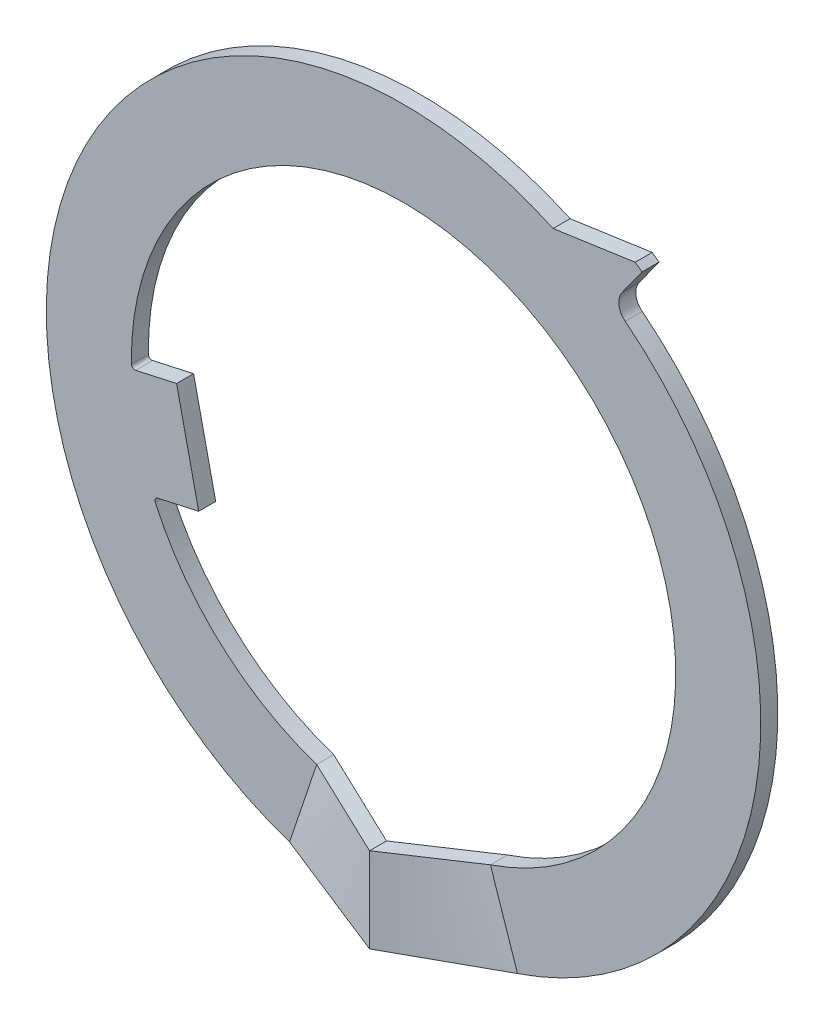
ISO-10303-21;
HEADER;
FILE_DESCRIPTION(('STEP AP214'),'2;1');
FILE_NAME('part.step','',(''),(''),'','','');
FILE_SCHEMA(('AUTOMOTIVE_DESIGN { 1 0 10303 214 1 1 1 1 }'));
ENDSEC;
DATA;
#1=APPLICATION_CONTEXT('core data for automotive mechanical design processes');
#2=APPLICATION_PROTOCOL_DEFINITION('international standard','automotive_design',2000,#1);
#3=PRODUCT_CONTEXT('',#1,'mechanical');
#4=PRODUCT('Part','Part','',(#3));
#5=PRODUCT_RELATED_PRODUCT_CATEGORY('part','',(#4));
#6=PRODUCT_DEFINITION_FORMATION('','',#4);
#7=PRODUCT_DEFINITION_CONTEXT('part definition',#1,'design');
#8=PRODUCT_DEFINITION('design','',#6,#7);
#9=PRODUCT_DEFINITION_SHAPE('','',#8);
#10=(LENGTH_UNIT() NAMED_UNIT(*) SI_UNIT(.MILLI.,.METRE.));
#11=(NAMED_UNIT(*) PLANE_ANGLE_UNIT() SI_UNIT($,.RADIAN.));
#12=(NAMED_UNIT(*) SI_UNIT($,.STERADIAN.) SOLID_ANGLE_UNIT());
#13=UNCERTAINTY_MEASURE_WITH_UNIT(LENGTH_MEASURE(1.E-05),#10,'distance_accuracy_value','');
#14=(GEOMETRIC_REPRESENTATION_CONTEXT(3) GLOBAL_UNCERTAINTY_ASSIGNED_CONTEXT((#13)) GLOBAL_UNIT_ASSIGNED_CONTEXT((#10,
#11,#12)) REPRESENTATION_CONTEXT('',''));
#15=CARTESIAN_POINT('',(0.,0.,0.));
#16=DIRECTION('',(0.,0.,1.));
#17=DIRECTION('',(1.,0.,0.));
#18=AXIS2_PLACEMENT_3D('',#15,#16,#17);
#19=CARTESIAN_POINT('',(0.,0.,-0.5));
#20=DIRECTION('',(0.,0.,1.));
#21=DIRECTION('',(1.,0.,0.));
#22=AXIS2_PLACEMENT_3D('',#19,#20,#21);
#23=CYLINDRICAL_SURFACE('',#22,10.5);
#24=CARTESIAN_POINT('',(0.,0.,0.));
#25=DIRECTION('',(0.,0.,1.));
#26=DIRECTION('',(1.,0.,0.));
#27=AXIS2_PLACEMENT_3D('',#24,#25,#26);
#28=CIRCLE('',#27,10.5);
#29=CARTESIAN_POINT('',(3.35,-9.95125620210835,0.));
#30=VERTEX_POINT('',#29);
#31=CARTESIAN_POINT('',(6.51562292120914,8.2338725973028,0.));
#32=VERTEX_POINT('',#31);
#33=EDGE_CURVE('E419',#30,#32,#28,.T.);
#34=ORIENTED_EDGE('',*,*,#33,.F.);
#35=DIRECTION('',(0.,0.,-1.));
#36=VECTOR('',#35,1.);
#37=CARTESIAN_POINT('',(3.35,-9.95125620210835,0.));
#38=LINE('',#37,#36);
#39=CARTESIAN_POINT('',(3.35,-9.95125620210835,-0.5));
#40=VERTEX_POINT('',#39);
#41=EDGE_CURVE('E187',#30,#40,#38,.T.);
#42=ORIENTED_EDGE('',*,*,#41,.T.);
#43=CARTESIAN_POINT('',(0.,0.,-0.5));
#44=DIRECTION('',(0.,0.,1.));
#45=DIRECTION('',(1.,0.,0.));
#46=AXIS2_PLACEMENT_3D('',#43,#44,#45);
#47=CIRCLE('',#46,10.5);
#48=CARTESIAN_POINT('',(6.51562292120914,8.2338725973028,-0.5));
#49=VERTEX_POINT('',#48);
#50=EDGE_CURVE('E181',#40,#49,#47,.T.);
#51=ORIENTED_EDGE('',*,*,#50,.T.);
#52=DIRECTION('',(0.,0.,1.));
#53=VECTOR('',#52,1.);
#54=CARTESIAN_POINT('',(6.51562292120914,8.2338725973028,-0.5));
#55=LINE('',#54,#53);
#56=EDGE_CURVE('E184',#49,#32,#55,.T.);
#57=ORIENTED_EDGE('',*,*,#56,.T.);
#58=EDGE_LOOP('',(#34,#42,#51,#57));
#59=FACE_BOUND('',#58,.T.);
#60=ADVANCED_FACE('F58',(#59),#23,.T.);
#61=CARTESIAN_POINT('',(4.39592724414307,9.53550332516332,-0.5));
#62=VERTEX_POINT('',#61);
#63=CARTESIAN_POINT('',(-3.35,-9.95125620210835,-0.5));
#64=VERTEX_POINT('',#63);
#65=EDGE_CURVE('E190',#62,#64,#47,.T.);
#66=ORIENTED_EDGE('',*,*,#65,.T.);
#67=DIRECTION('',(0.,0.,1.));
#68=VECTOR('',#67,1.);
#69=CARTESIAN_POINT('',(-3.35,-9.95125620210835,0.));
#70=LINE('',#69,#68);
#71=CARTESIAN_POINT('',(-3.35,-9.95125620210835,0.));
#72=VERTEX_POINT('',#71);
#73=EDGE_CURVE('E212',#72,#64,#70,.F.);
#74=ORIENTED_EDGE('',*,*,#73,.F.);
#75=CARTESIAN_POINT('',(4.39592724414307,9.53550332516332,0.));
#76=VERTEX_POINT('',#75);
#77=EDGE_CURVE('E431',#76,#72,#28,.T.);
#78=ORIENTED_EDGE('',*,*,#77,.F.);
#79=DIRECTION('',(0.,0.,1.));
#80=VECTOR('',#79,1.);
#81=CARTESIAN_POINT('',(4.39592724414307,9.53550332516332,-0.5));
#82=LINE('',#81,#80);
#83=EDGE_CURVE('E439',#62,#76,#82,.T.);
#84=ORIENTED_EDGE('',*,*,#83,.F.);
#85=EDGE_LOOP('',(#66,#74,#78,#84));
#86=FACE_BOUND('',#85,.T.);
#87=ADVANCED_FACE('F486',(#86),#23,.T.);
#88=CARTESIAN_POINT('',(0.,0.,-0.5));
#89=DIRECTION('',(0.,0.,1.));
#90=DIRECTION('',(1.,0.,0.));
#91=AXIS2_PLACEMENT_3D('',#88,#89,#90);
#92=PLANE('',#91);
#93=DIRECTION('',(-0.31904761904762,0.947738685915081,0.));
#94=VECTOR('',#93,1.);
#95=CARTESIAN_POINT('',(2.55238095238095,-7.58190948732065,-0.5));
#96=LINE('',#95,#94);
#97=CARTESIAN_POINT('',(2.55238095238095,-7.58190948732065,-0.5));
#98=VERTEX_POINT('',#97);
#99=EDGE_CURVE('E211',#40,#98,#96,.T.);
#100=ORIENTED_EDGE('',*,*,#99,.T.);
#101=CARTESIAN_POINT('',(0.,0.,-0.5));
#102=DIRECTION('',(0.,0.,1.));
#103=DIRECTION('',(1.,0.,0.));
#104=AXIS2_PLACEMENT_3D('',#101,#102,#103);
#105=CIRCLE('',#104,8.);
#106=CARTESIAN_POINT('',(-7.99919075894747,-0.113785772262406,-0.5));
#107=VERTEX_POINT('',#106);
#108=EDGE_CURVE('E402',#98,#107,#105,.T.);
#109=ORIENTED_EDGE('',*,*,#108,.T.);
#110=CARTESIAN_POINT('',(-7.89920087446063,-0.112363450109126,-0.5));
#111=DIRECTION('',(0.,0.,1.));
#112=DIRECTION('',(1.,0.,0.));
#113=AXIS2_PLACEMENT_3D('',#110,#111,#112);
#114=CIRCLE('',#113,0.1);
#115=CARTESIAN_POINT('',(-7.87755691306682,-0.20999305082112,-0.5));
#116=VERTEX_POINT('',#115);
#117=EDGE_CURVE('E459',#107,#116,#114,.T.);
#118=ORIENTED_EDGE('',*,*,#117,.T.);
#119=DIRECTION('',(0.976296007119934,0.2164396139381,0.));
#120=VECTOR('',#119,1.);
#121=CARTESIAN_POINT('',(-6.67058346718672,0.0575865200822516,-0.5));
#122=LINE('',#121,#120);
#123=CARTESIAN_POINT('',(-6.67058346718672,0.0575865200822516,-0.5));
#124=VERTEX_POINT('',#123);
#125=EDGE_CURVE('E405',#116,#124,#122,.T.);
#126=ORIENTED_EDGE('',*,*,#125,.T.);
#127=DIRECTION('',(0.2164396139381,-0.976296007119934,0.));
#128=VECTOR('',#127,1.);
#129=CARTESIAN_POINT('',(-6.67058346718672,0.0575865200822516,-0.5));
#130=LINE('',#129,#128);
#131=CARTESIAN_POINT('',(-6.02126462537242,-2.87130150127755,-0.5));
#132=VERTEX_POINT('',#131);
#133=EDGE_CURVE('E395',#124,#132,#130,.T.);
#134=ORIENTED_EDGE('',*,*,#133,.T.);
#135=DIRECTION('',(-0.976296007119934,-0.2164396139381,0.));
#136=VECTOR('',#135,1.);
#137=CARTESIAN_POINT('',(-6.02126462537242,-2.87130150127755,-0.5));
#138=LINE('',#137,#136);
#139=CARTESIAN_POINT('',(-7.22823807125252,-3.13888107218092,-0.5));
#140=VERTEX_POINT('',#139);
#141=EDGE_CURVE('E398',#132,#140,#138,.T.);
#142=ORIENTED_EDGE('',*,*,#141,.T.);
#143=CARTESIAN_POINT('',(-7.20659410985871,-3.23651067289292,-0.5));
#144=DIRECTION('',(0.,0.,1.));
#145=DIRECTION('',(1.,0.,0.));
#146=AXIS2_PLACEMENT_3D('',#143,#144,#145);
#147=CIRCLE('',#146,0.1);
#148=CARTESIAN_POINT('',(-7.29781682011008,-3.2774791624232,-0.5));
#149=VERTEX_POINT('',#148);
#150=EDGE_CURVE('E199',#140,#149,#147,.T.);
#151=ORIENTED_EDGE('',*,*,#150,.T.);
#152=CARTESIAN_POINT('',(-2.55238095238095,-7.58190948732065,-0.5));
#153=VERTEX_POINT('',#152);
#154=EDGE_CURVE('E404',#149,#153,#105,.T.);
#155=ORIENTED_EDGE('',*,*,#154,.T.);
#156=DIRECTION('',(-0.319047619047619,-0.947738685915081,0.));
#157=VECTOR('',#156,1.);
#158=CARTESIAN_POINT('',(-2.55238095238095,-7.58190948732065,-0.5));
#159=LINE('',#158,#157);
#160=EDGE_CURVE('E207',#153,#64,#159,.T.);
#161=ORIENTED_EDGE('',*,*,#160,.T.);
#162=ORIENTED_EDGE('',*,*,#65,.F.);
#163=DIRECTION('',(-0.989779692430382,-0.142604910337683,0.));
#164=VECTOR('',#163,1.);
#165=CARTESIAN_POINT('',(4.39592724414307,9.53550332516332,-0.5));
#166=LINE('',#165,#164);
#167=CARTESIAN_POINT('',(6.80659574026715,9.8828262368908,-0.5));
#168=VERTEX_POINT('',#167);
#169=EDGE_CURVE('E426',#168,#62,#166,.T.);
#170=ORIENTED_EDGE('',*,*,#169,.F.);
#171=CARTESIAN_POINT('',(0.,0.,-0.5));
#172=DIRECTION('',(0.,0.,1.));
#173=DIRECTION('',(1.,0.,0.));
#174=AXIS2_PLACEMENT_3D('',#171,#172,#173);
#175=CIRCLE('',#174,12.);
#176=CARTESIAN_POINT('',(7.0109959876493,9.73888778358009,-0.5));
#177=VERTEX_POINT('',#176);
#178=EDGE_CURVE('E423',#177,#168,#175,.T.);
#179=ORIENTED_EDGE('',*,*,#178,.F.);
#180=DIRECTION('',(0.584249665637441,0.811573981965007,0.));
#181=VECTOR('',#180,1.);
#182=CARTESIAN_POINT('',(6.13462148919313,8.52152681063258,-0.5));
#183=LINE('',#182,#181);
#184=CARTESIAN_POINT('',(6.42010368837946,8.91808660142166,-0.5));
#185=VERTEX_POINT('',#184);
#186=EDGE_CURVE('E196',#185,#177,#183,.T.);
#187=ORIENTED_EDGE('',*,*,#186,.F.);
#188=CARTESIAN_POINT('',(6.82589067936196,8.62596176860294,-0.5));
#189=DIRECTION('',(0.,0.,1.));
#190=DIRECTION('',(1.,0.,0.));
#191=AXIS2_PLACEMENT_3D('',#188,#189,#190);
#192=CIRCLE('',#191,0.5);
#193=EDGE_CURVE('E12',#185,#49,#192,.T.);
#194=ORIENTED_EDGE('',*,*,#193,.T.);
#195=ORIENTED_EDGE('',*,*,#50,.F.);
#196=EDGE_LOOP('',(#100,#109,#118,#126,#134,#142,#151,#155,#161,#162,#170,#179,#187,#194,#195));
#197=FACE_BOUND('',#196,.T.);
#198=ADVANCED_FACE('F194',(#197),#92,.F.);
#199=CARTESIAN_POINT('',(0.,0.,0.));
#200=DIRECTION('',(0.,0.,1.));
#201=DIRECTION('',(1.,0.,0.));
#202=AXIS2_PLACEMENT_3D('',#199,#200,#201);
#203=PLANE('',#202);
#204=CARTESIAN_POINT('',(0.,0.,0.));
#205=DIRECTION('',(0.,0.,1.));
#206=DIRECTION('',(1.,0.,0.));
#207=AXIS2_PLACEMENT_3D('',#204,#205,#206);
#208=CIRCLE('',#207,8.);
#209=CARTESIAN_POINT('',(2.55238095238095,-7.58190948732065,0.));
#210=VERTEX_POINT('',#209);
#211=CARTESIAN_POINT('',(-7.99919075894747,-0.113785772262406,0.));
#212=VERTEX_POINT('',#211);
#213=EDGE_CURVE('E412',#210,#212,#208,.T.);
#214=ORIENTED_EDGE('',*,*,#213,.F.);
#215=DIRECTION('',(-0.31904761904762,0.947738685915081,0.));
#216=VECTOR('',#215,1.);
#217=CARTESIAN_POINT('',(2.55238095238095,-7.58190948732065,0.));
#218=LINE('',#217,#216);
#219=EDGE_CURVE('E210',#30,#210,#218,.T.);
#220=ORIENTED_EDGE('',*,*,#219,.F.);
#221=ORIENTED_EDGE('',*,*,#33,.T.);
#222=CARTESIAN_POINT('',(6.82589067936196,8.62596176860294,0.));
#223=DIRECTION('',(0.,0.,1.));
#224=DIRECTION('',(1.,0.,0.));
#225=AXIS2_PLACEMENT_3D('',#222,#223,#224);
#226=CIRCLE('',#225,0.5);
#227=CARTESIAN_POINT('',(6.42010368837946,8.91808660142166,0.));
#228=VERTEX_POINT('',#227);
#229=EDGE_CURVE('E68',#32,#228,#226,.F.);
#230=ORIENTED_EDGE('',*,*,#229,.T.);
#231=DIRECTION('',(0.584249665637441,0.811573981965007,0.));
#232=VECTOR('',#231,1.);
#233=CARTESIAN_POINT('',(6.13462148919313,8.52152681063258,0.));
#234=LINE('',#233,#232);
#235=CARTESIAN_POINT('',(7.0109959876493,9.73888778358009,0.));
#236=VERTEX_POINT('',#235);
#237=EDGE_CURVE('E432',#228,#236,#234,.T.);
#238=ORIENTED_EDGE('',*,*,#237,.T.);
#239=CARTESIAN_POINT('',(0.,0.,0.));
#240=DIRECTION('',(0.,0.,1.));
#241=DIRECTION('',(1.,0.,0.));
#242=AXIS2_PLACEMENT_3D('',#239,#240,#241);
#243=CIRCLE('',#242,12.);
#244=CARTESIAN_POINT('',(6.80659574026715,9.8828262368908,0.));
#245=VERTEX_POINT('',#244);
#246=EDGE_CURVE('E434',#236,#245,#243,.T.);
#247=ORIENTED_EDGE('',*,*,#246,.T.);
#248=DIRECTION('',(-0.989779692430382,-0.142604910337683,0.));
#249=VECTOR('',#248,1.);
#250=CARTESIAN_POINT('',(4.39592724414307,9.53550332516332,0.));
#251=LINE('',#250,#249);
#252=EDGE_CURVE('E191',#245,#76,#251,.T.);
#253=ORIENTED_EDGE('',*,*,#252,.T.);
#254=ORIENTED_EDGE('',*,*,#77,.T.);
#255=DIRECTION('',(0.319047619047619,0.947738685915081,0.));
#256=VECTOR('',#255,1.);
#257=CARTESIAN_POINT('',(-3.35,-9.95125620210835,0.));
#258=LINE('',#257,#256);
#259=CARTESIAN_POINT('',(-2.55238095238095,-7.58190948732065,0.));
#260=VERTEX_POINT('',#259);
#261=EDGE_CURVE('E107',#260,#72,#258,.F.);
#262=ORIENTED_EDGE('',*,*,#261,.F.);
#263=CARTESIAN_POINT('',(-7.29781682011008,-3.2774791624232,0.));
#264=VERTEX_POINT('',#263);
#265=EDGE_CURVE('E414',#264,#260,#208,.T.);
#266=ORIENTED_EDGE('',*,*,#265,.F.);
#267=CARTESIAN_POINT('',(-7.20659410985871,-3.23651067289292,0.));
#268=DIRECTION('',(0.,0.,1.));
#269=DIRECTION('',(1.,0.,0.));
#270=AXIS2_PLACEMENT_3D('',#267,#268,#269);
#271=CIRCLE('',#270,0.1);
#272=CARTESIAN_POINT('',(-7.22823807125252,-3.13888107218092,0.));
#273=VERTEX_POINT('',#272);
#274=EDGE_CURVE('E202',#264,#273,#271,.F.);
#275=ORIENTED_EDGE('',*,*,#274,.T.);
#276=DIRECTION('',(-0.976296007119934,-0.2164396139381,0.));
#277=VECTOR('',#276,1.);
#278=CARTESIAN_POINT('',(-6.02126462537242,-2.87130150127755,0.));
#279=LINE('',#278,#277);
#280=CARTESIAN_POINT('',(-6.02126462537242,-2.87130150127755,0.));
#281=VERTEX_POINT('',#280);
#282=EDGE_CURVE('E409',#281,#273,#279,.T.);
#283=ORIENTED_EDGE('',*,*,#282,.F.);
#284=DIRECTION('',(0.2164396139381,-0.976296007119934,0.));
#285=VECTOR('',#284,1.);
#286=CARTESIAN_POINT('',(-6.67058346718672,0.0575865200822516,0.));
#287=LINE('',#286,#285);
#288=CARTESIAN_POINT('',(-6.67058346718672,0.0575865200822516,0.));
#289=VERTEX_POINT('',#288);
#290=EDGE_CURVE('E394',#289,#281,#287,.T.);
#291=ORIENTED_EDGE('',*,*,#290,.F.);
#292=DIRECTION('',(0.976296007119934,0.2164396139381,0.));
#293=VECTOR('',#292,1.);
#294=CARTESIAN_POINT('',(-6.67058346718672,0.0575865200822516,0.));
#295=LINE('',#294,#293);
#296=CARTESIAN_POINT('',(-7.87755691306682,-0.20999305082112,0.));
#297=VERTEX_POINT('',#296);
#298=EDGE_CURVE('E399',#297,#289,#295,.T.);
#299=ORIENTED_EDGE('',*,*,#298,.F.);
#300=CARTESIAN_POINT('',(-7.89920087446063,-0.112363450109126,0.));
#301=DIRECTION('',(0.,0.,1.));
#302=DIRECTION('',(1.,0.,0.));
#303=AXIS2_PLACEMENT_3D('',#300,#301,#302);
#304=CIRCLE('',#303,0.1);
#305=EDGE_CURVE('E456',#297,#212,#304,.F.);
#306=ORIENTED_EDGE('',*,*,#305,.T.);
#307=EDGE_LOOP('',(#214,#220,#221,#230,#238,#247,#253,#254,#262,#266,#275,#283,#291,#299,#306));
#308=FACE_BOUND('',#307,.T.);
#309=ADVANCED_FACE('F462',(#308),#203,.T.);
#310=CARTESIAN_POINT('',(0.,0.,-0.5));
#311=DIRECTION('',(0.,0.,1.));
#312=DIRECTION('',(1.,0.,0.));
#313=AXIS2_PLACEMENT_3D('',#310,#311,#312);
#314=CYLINDRICAL_SURFACE('',#313,8.);
#315=DIRECTION('',(0.,0.,-1.));
#316=VECTOR('',#315,1.);
#317=CARTESIAN_POINT('',(2.55238095238095,-7.58190948732065,0.));
#318=LINE('',#317,#316);
#319=EDGE_CURVE('E115',#210,#98,#318,.T.);
#320=ORIENTED_EDGE('',*,*,#319,.F.);
#321=ORIENTED_EDGE('',*,*,#213,.T.);
#322=DIRECTION('',(0.,0.,1.));
#323=VECTOR('',#322,1.);
#324=CARTESIAN_POINT('',(-7.99919075894747,-0.113785772262406,-0.5));
#325=LINE('',#324,#323);
#326=EDGE_CURVE('E451',#212,#107,#325,.F.);
#327=ORIENTED_EDGE('',*,*,#326,.T.);
#328=ORIENTED_EDGE('',*,*,#108,.F.);
#329=EDGE_LOOP('',(#320,#321,#327,#328));
#330=FACE_BOUND('',#329,.T.);
#331=ADVANCED_FACE('F475',(#330),#314,.F.);
#332=DIRECTION('',(0.,0.,1.));
#333=VECTOR('',#332,1.);
#334=CARTESIAN_POINT('',(-2.55238095238095,-7.58190948732065,-0.5));
#335=LINE('',#334,#333);
#336=EDGE_CURVE('E76',#260,#153,#335,.F.);
#337=ORIENTED_EDGE('',*,*,#336,.T.);
#338=ORIENTED_EDGE('',*,*,#154,.F.);
#339=DIRECTION('',(0.,0.,1.));
#340=VECTOR('',#339,1.);
#341=CARTESIAN_POINT('',(-7.29781682011008,-3.27747916242321,-0.5));
#342=LINE('',#341,#340);
#343=EDGE_CURVE('E448',#149,#264,#342,.T.);
#344=ORIENTED_EDGE('',*,*,#343,.T.);
#345=ORIENTED_EDGE('',*,*,#265,.T.);
#346=EDGE_LOOP('',(#337,#338,#344,#345));
#347=FACE_BOUND('',#346,.T.);
#348=ADVANCED_FACE('F472',(#347),#314,.F.);
#349=CARTESIAN_POINT('',(4.39592724414307,9.53550332516332,-0.5));
#350=DIRECTION('',(-0.142604910337682,0.989779692430382,0.));
#351=DIRECTION('',(-0.989779692430382,-0.142604910337682,0.));
#352=AXIS2_PLACEMENT_3D('',#349,#350,#351);
#353=PLANE('',#352);
#354=ORIENTED_EDGE('',*,*,#252,.F.);
#355=DIRECTION('',(0.,0.,1.));
#356=VECTOR('',#355,1.);
#357=CARTESIAN_POINT('',(6.80659574026715,9.8828262368908,-0.5));
#358=LINE('',#357,#356);
#359=EDGE_CURVE('E442',#168,#245,#358,.T.);
#360=ORIENTED_EDGE('',*,*,#359,.F.);
#361=ORIENTED_EDGE('',*,*,#169,.T.);
#362=ORIENTED_EDGE('',*,*,#83,.T.);
#363=EDGE_LOOP('',(#354,#360,#361,#362));
#364=FACE_BOUND('',#363,.T.);
#365=ADVANCED_FACE('F474',(#364),#353,.T.);
#366=CARTESIAN_POINT('',(0.,0.,-0.5));
#367=DIRECTION('',(0.,0.,1.));
#368=DIRECTION('',(1.,0.,0.));
#369=AXIS2_PLACEMENT_3D('',#366,#367,#368);
#370=CYLINDRICAL_SURFACE('',#369,12.);
#371=ORIENTED_EDGE('',*,*,#246,.F.);
#372=DIRECTION('',(0.,0.,1.));
#373=VECTOR('',#372,1.);
#374=CARTESIAN_POINT('',(7.0109959876493,9.73888778358009,-0.5));
#375=LINE('',#374,#373);
#376=EDGE_CURVE('E429',#177,#236,#375,.T.);
#377=ORIENTED_EDGE('',*,*,#376,.F.);
#378=ORIENTED_EDGE('',*,*,#178,.T.);
#379=ORIENTED_EDGE('',*,*,#359,.T.);
#380=EDGE_LOOP('',(#371,#377,#378,#379));
#381=FACE_BOUND('',#380,.T.);
#382=ADVANCED_FACE('F480',(#381),#370,.T.);
#383=CARTESIAN_POINT('',(6.13462148919313,8.52152681063258,-0.5));
#384=DIRECTION('',(0.811573981965008,-0.584249665637441,0.));
#385=DIRECTION('',(0.584249665637441,0.811573981965008,0.));
#386=AXIS2_PLACEMENT_3D('',#383,#384,#385);
#387=PLANE('',#386);
#388=ORIENTED_EDGE('',*,*,#237,.F.);
#389=DIRECTION('',(0.,0.,-1.));
#390=VECTOR('',#389,1.);
#391=CARTESIAN_POINT('',(6.42010368837946,8.91808660142166,-0.5));
#392=LINE('',#391,#390);
#393=EDGE_CURVE('E85',#228,#185,#392,.T.);
#394=ORIENTED_EDGE('',*,*,#393,.T.);
#395=ORIENTED_EDGE('',*,*,#186,.T.);
#396=ORIENTED_EDGE('',*,*,#376,.T.);
#397=EDGE_LOOP('',(#388,#394,#395,#396));
#398=FACE_BOUND('',#397,.T.);
#399=ADVANCED_FACE('F494',(#398),#387,.T.);
#400=CARTESIAN_POINT('',(-6.67058346718672,0.0575865200822516,-0.5));
#401=DIRECTION('',(-0.976296007119934,-0.2164396139381,0.));
#402=DIRECTION('',(0.2164396139381,-0.976296007119934,0.));
#403=AXIS2_PLACEMENT_3D('',#400,#401,#402);
#404=PLANE('',#403);
#405=ORIENTED_EDGE('',*,*,#290,.T.);
#406=DIRECTION('',(0.,0.,1.));
#407=VECTOR('',#406,1.);
#408=CARTESIAN_POINT('',(-6.02126462537242,-2.87130150127755,-0.5));
#409=LINE('',#408,#407);
#410=EDGE_CURVE('E407',#132,#281,#409,.T.);
#411=ORIENTED_EDGE('',*,*,#410,.F.);
#412=ORIENTED_EDGE('',*,*,#133,.F.);
#413=DIRECTION('',(0.,0.,1.));
#414=VECTOR('',#413,1.);
#415=CARTESIAN_POINT('',(-6.67058346718672,0.0575865200822516,-0.5));
#416=LINE('',#415,#414);
#417=EDGE_CURVE('E416',#124,#289,#416,.T.);
#418=ORIENTED_EDGE('',*,*,#417,.T.);
#419=EDGE_LOOP('',(#405,#411,#412,#418));
#420=FACE_BOUND('',#419,.T.);
#421=ADVANCED_FACE('F626',(#420),#404,.F.);
#422=CARTESIAN_POINT('',(-6.67058346718672,0.0575865200822516,-0.5));
#423=DIRECTION('',(0.2164396139381,-0.976296007119934,0.));
#424=DIRECTION('',(0.976296007119934,0.2164396139381,0.));
#425=AXIS2_PLACEMENT_3D('',#422,#423,#424);
#426=PLANE('',#425);
#427=ORIENTED_EDGE('',*,*,#125,.F.);
#428=DIRECTION('',(0.,0.,-1.));
#429=VECTOR('',#428,1.);
#430=CARTESIAN_POINT('',(-7.87755691306682,-0.20999305082112,0.));
#431=LINE('',#430,#429);
#432=EDGE_CURVE('E441',#116,#297,#431,.F.);
#433=ORIENTED_EDGE('',*,*,#432,.T.);
#434=ORIENTED_EDGE('',*,*,#298,.T.);
#435=ORIENTED_EDGE('',*,*,#417,.F.);
#436=EDGE_LOOP('',(#427,#433,#434,#435));
#437=FACE_BOUND('',#436,.T.);
#438=ADVANCED_FACE('F295',(#437),#426,.F.);
#439=CARTESIAN_POINT('',(-6.02126462537242,-2.87130150127755,-0.5));
#440=DIRECTION('',(-0.2164396139381,0.976296007119934,0.));
#441=DIRECTION('',(-0.976296007119934,-0.2164396139381,0.));
#442=AXIS2_PLACEMENT_3D('',#439,#440,#441);
#443=PLANE('',#442);
#444=ORIENTED_EDGE('',*,*,#282,.T.);
#445=DIRECTION('',(0.,0.,-1.));
#446=VECTOR('',#445,1.);
#447=CARTESIAN_POINT('',(-7.22823807125252,-3.13888107218092,-0.5));
#448=LINE('',#447,#446);
#449=EDGE_CURVE('E454',#273,#140,#448,.T.);
#450=ORIENTED_EDGE('',*,*,#449,.T.);
#451=ORIENTED_EDGE('',*,*,#141,.F.);
#452=ORIENTED_EDGE('',*,*,#410,.T.);
#453=EDGE_LOOP('',(#444,#450,#451,#452));
#454=FACE_BOUND('',#453,.T.);
#455=ADVANCED_FACE('F468',(#454),#443,.F.);
#456=CARTESIAN_POINT('',(-7.89920087446063,-0.112363450109126,-0.5));
#457=DIRECTION('',(0.,0.,1.));
#458=DIRECTION('',(1.,0.,0.));
#459=AXIS2_PLACEMENT_3D('',#456,#457,#458);
#460=CYLINDRICAL_SURFACE('',#459,0.1);
#461=ORIENTED_EDGE('',*,*,#117,.F.);
#462=ORIENTED_EDGE('',*,*,#326,.F.);
#463=ORIENTED_EDGE('',*,*,#305,.F.);
#464=ORIENTED_EDGE('',*,*,#432,.F.);
#465=EDGE_LOOP('',(#461,#462,#463,#464));
#466=FACE_BOUND('',#465,.T.);
#467=ADVANCED_FACE('F496',(#466),#460,.F.);
#468=CARTESIAN_POINT('',(-7.20659410985871,-3.23651067289292,-0.5));
#469=DIRECTION('',(0.,0.,1.));
#470=DIRECTION('',(1.,0.,0.));
#471=AXIS2_PLACEMENT_3D('',#468,#469,#470);
#472=CYLINDRICAL_SURFACE('',#471,0.1);
#473=ORIENTED_EDGE('',*,*,#150,.F.);
#474=ORIENTED_EDGE('',*,*,#449,.F.);
#475=ORIENTED_EDGE('',*,*,#274,.F.);
#476=ORIENTED_EDGE('',*,*,#343,.F.);
#477=EDGE_LOOP('',(#473,#474,#475,#476));
#478=FACE_BOUND('',#477,.T.);
#479=ADVANCED_FACE('F471',(#478),#472,.F.);
#480=CARTESIAN_POINT('',(6.82589067936196,8.62596176860294,-0.5));
#481=DIRECTION('',(0.,0.,1.));
#482=DIRECTION('',(1.,0.,0.));
#483=AXIS2_PLACEMENT_3D('',#480,#481,#482);
#484=CYLINDRICAL_SURFACE('',#483,0.5);
#485=ORIENTED_EDGE('',*,*,#193,.F.);
#486=ORIENTED_EDGE('',*,*,#393,.F.);
#487=ORIENTED_EDGE('',*,*,#229,.F.);
#488=ORIENTED_EDGE('',*,*,#56,.F.);
#489=EDGE_LOOP('',(#485,#486,#487,#488));
#490=FACE_BOUND('',#489,.T.);
#491=ADVANCED_FACE('F60',(#490),#484,.F.);
#492=CARTESIAN_POINT('',(-2.55238095238095,-7.58190948732065,0.));
#493=CARTESIAN_POINT('',(0.,-8.,1.));
#494=CARTESIAN_POINT('',(-2.68531746031746,-7.97680060645194,0.));
#495=CARTESIAN_POINT('',(0.,-8.41666666666663,1.));
#496=CARTESIAN_POINT('',(-2.81825396825397,-8.37169172558323,0.));
#497=CARTESIAN_POINT('',(0.,-8.83333333333328,1.));
#498=CARTESIAN_POINT('',(-3.08412698412699,-9.1614739638458,0.));
#499=CARTESIAN_POINT('',(0.,-9.66666666666661,1.));
#500=CARTESIAN_POINT('',(-3.21706349206349,-9.55636508297708,0.));
#501=CARTESIAN_POINT('',(0.,-10.0833333333333,1.));
#502=CARTESIAN_POINT('',(-3.35,-9.95125620210835,0.));
#503=CARTESIAN_POINT('',(0.,-10.5,1.));
#504=B_SPLINE_SURFACE_WITH_KNOTS('',3,1,((#492,#493),(#494,#495),(#496,#497),(#498,#499),(#500,
#501),(#502,#503)),.UNSPECIFIED.,.F.,.F.,.F.,(4,2,4),(2,2),(0.,0.5,1.),(0.,1.),.UNSPECIFIED.);
#505=DIRECTION('',(0.946629142920687,-0.155061752561556,0.282575863558414));
#506=VECTOR('',#505,1.);
#507=CARTESIAN_POINT('',(-1.675,-10.2256281010542,0.5));
#508=LINE('',#507,#506);
#509=CARTESIAN_POINT('',(0.,-10.5,1.));
#510=VERTEX_POINT('',#509);
#511=EDGE_CURVE('E254',#72,#510,#508,.T.);
#512=DIRECTION('',(0.,-1.,0.));
#513=VECTOR('',#512,1.);
#514=CARTESIAN_POINT('',(0.,-8.,1.));
#515=LINE('',#514,#513);
#516=CARTESIAN_POINT('',(0.,-8.,1.));
#517=VERTEX_POINT('',#516);
#518=EDGE_CURVE('E62',#517,#510,#515,.T.);
#519=DIRECTION('',(-0.920445135939133,0.150772704371981,-0.360622161468691));
#520=VECTOR('',#519,1.);
#521=CARTESIAN_POINT('',(-1.27619047619047,-7.79095474366032,0.5));
#522=LINE('',#521,#520);
#523=EDGE_CURVE('E261',#517,#260,#522,.T.);
#524=ORIENTED_EDGE('',*,*,#261,.T.);
#525=ORIENTED_EDGE('',*,*,#511,.T.);
#526=ORIENTED_EDGE('',*,*,#518,.F.);
#527=ORIENTED_EDGE('',*,*,#523,.T.);
#528=EDGE_LOOP('',(#524,#525,#526,#527));
#529=FACE_BOUND('',#528,.T.);
#530=ADVANCED_FACE('F325',(#529),#504,.T.);
#531=CARTESIAN_POINT('',(-1.675,-10.2256281010542,0.));
#532=DIRECTION('',(0.161649797532998,0.986848186377996,0.));
#533=DIRECTION('',(-0.986848186377996,0.161649797532998,0.));
#534=AXIS2_PLACEMENT_3D('',#531,#532,#533);
#535=PLANE('',#534);
#536=DIRECTION('',(0.946629142920687,-0.155061752561556,0.282575863558414));
#537=VECTOR('',#536,1.);
#538=CARTESIAN_POINT('',(-3.35,-9.95125620210835,-0.5));
#539=LINE('',#538,#537);
#540=CARTESIAN_POINT('',(0.,-10.5,0.5));
#541=VERTEX_POINT('',#540);
#542=EDGE_CURVE('E246',#64,#541,#539,.T.);
#543=ORIENTED_EDGE('',*,*,#542,.T.);
#544=DIRECTION('',(0.,0.,-1.));
#545=VECTOR('',#544,1.);
#546=CARTESIAN_POINT('',(0.,-10.5,1.));
#547=LINE('',#546,#545);
#548=EDGE_CURVE('E231',#510,#541,#547,.T.);
#549=ORIENTED_EDGE('',*,*,#548,.F.);
#550=ORIENTED_EDGE('',*,*,#511,.F.);
#551=ORIENTED_EDGE('',*,*,#73,.T.);
#552=EDGE_LOOP('',(#543,#549,#550,#551));
#553=FACE_BOUND('',#552,.T.);
#554=ADVANCED_FACE('F286',(#553),#535,.F.);
#555=CARTESIAN_POINT('',(-1.27619047619049,-7.79095474366032,0.));
#556=DIRECTION('',(-0.161649797532999,-0.986848186377996,0.));
#557=DIRECTION('',(0.986848186377996,-0.161649797532999,0.));
#558=AXIS2_PLACEMENT_3D('',#555,#556,#557);
#559=PLANE('',#558);
#560=ORIENTED_EDGE('',*,*,#523,.F.);
#561=DIRECTION('',(0.,0.,1.));
#562=VECTOR('',#561,1.);
#563=CARTESIAN_POINT('',(0.,-8.,1.));
#564=LINE('',#563,#562);
#565=CARTESIAN_POINT('',(0.,-8.,0.5));
#566=VERTEX_POINT('',#565);
#567=EDGE_CURVE('E217',#566,#517,#564,.T.);
#568=ORIENTED_EDGE('',*,*,#567,.F.);
#569=DIRECTION('',(0.920445135939133,-0.15077270437198,0.360622161468691));
#570=VECTOR('',#569,1.);
#571=CARTESIAN_POINT('',(-1.27619047619047,-7.79095474366033,0.));
#572=LINE('',#571,#570);
#573=EDGE_CURVE('E240',#153,#566,#572,.T.);
#574=ORIENTED_EDGE('',*,*,#573,.F.);
#575=ORIENTED_EDGE('',*,*,#336,.F.);
#576=EDGE_LOOP('',(#560,#568,#574,#575));
#577=FACE_BOUND('',#576,.T.);
#578=ADVANCED_FACE('F275',(#577),#559,.F.);
#579=CARTESIAN_POINT('',(-3.35,-9.95125620210835,-0.5));
#580=CARTESIAN_POINT('',(0.,-10.5,0.5));
#581=CARTESIAN_POINT('',(-3.21706349206349,-9.55636508297708,-0.5));
#582=CARTESIAN_POINT('',(0.,-10.0833333333332,0.5));
#583=CARTESIAN_POINT('',(-3.08412698412699,-9.1614739638458,-0.5));
#584=CARTESIAN_POINT('',(0.,-9.66666666666649,0.5));
#585=CARTESIAN_POINT('',(-2.81825396825397,-8.37169172558323,-0.5));
#586=CARTESIAN_POINT('',(0.,-8.83333333333316,0.5));
#587=CARTESIAN_POINT('',(-2.68531746031746,-7.97680060645194,-0.5));
#588=CARTESIAN_POINT('',(0.,-8.41666666666655,0.5));
#589=CARTESIAN_POINT('',(-2.55238095238095,-7.58190948732065,-0.5));
#590=CARTESIAN_POINT('',(0.,-8.,0.5));
#591=B_SPLINE_SURFACE_WITH_KNOTS('',3,1,((#579,#580),(#581,#582),(#583,#584),(#585,#586),(#587,
#588),(#589,#590)),.UNSPECIFIED.,.F.,.F.,.F.,(4,2,4),(2,2),(0.,0.5,1.),(0.,1.),.UNSPECIFIED.);
#592=DIRECTION('',(0.,1.,0.));
#593=VECTOR('',#592,1.);
#594=CARTESIAN_POINT('',(0.,-8.,0.5));
#595=LINE('',#594,#593);
#596=EDGE_CURVE('E221',#541,#566,#595,.T.);
#597=ORIENTED_EDGE('',*,*,#160,.F.);
#598=ORIENTED_EDGE('',*,*,#573,.T.);
#599=ORIENTED_EDGE('',*,*,#596,.F.);
#600=ORIENTED_EDGE('',*,*,#542,.F.);
#601=EDGE_LOOP('',(#597,#598,#599,#600));
#602=FACE_BOUND('',#601,.T.);
#603=ADVANCED_FACE('F285',(#602),#591,.T.);
#604=CARTESIAN_POINT('',(1.675,-10.2256281010542,0.));
#605=DIRECTION('',(-0.161649797532998,0.986848186377996,0.));
#606=DIRECTION('',(0.986848186377996,0.161649797532998,0.));
#607=AXIS2_PLACEMENT_3D('',#604,#605,#606);
#608=PLANE('',#607);
#609=DIRECTION('',(-0.946629142920687,-0.155061752561556,0.282575863558414));
#610=VECTOR('',#609,1.);
#611=CARTESIAN_POINT('',(3.35,-9.95125620210835,-0.5));
#612=LINE('',#611,#610);
#613=EDGE_CURVE('E362',#40,#541,#612,.T.);
#614=ORIENTED_EDGE('',*,*,#613,.F.);
#615=ORIENTED_EDGE('',*,*,#41,.F.);
#616=DIRECTION('',(-0.946629142920687,-0.155061752561556,0.282575863558414));
#617=VECTOR('',#616,1.);
#618=CARTESIAN_POINT('',(1.675,-10.2256281010542,0.5));
#619=LINE('',#618,#617);
#620=EDGE_CURVE('E264',#30,#510,#619,.T.);
#621=ORIENTED_EDGE('',*,*,#620,.T.);
#622=ORIENTED_EDGE('',*,*,#548,.T.);
#623=EDGE_LOOP('',(#614,#615,#621,#622));
#624=FACE_BOUND('',#623,.T.);
#625=ADVANCED_FACE('F294',(#624),#608,.F.);
#626=CARTESIAN_POINT('',(2.55238095238095,-7.58190948732065,0.));
#627=CARTESIAN_POINT('',(0.,-8.,1.));
#628=CARTESIAN_POINT('',(2.68531746031746,-7.97680060645194,0.));
#629=CARTESIAN_POINT('',(0.,-8.41666666666663,1.));
#630=CARTESIAN_POINT('',(2.81825396825397,-8.37169172558323,0.));
#631=CARTESIAN_POINT('',(0.,-8.83333333333328,1.));
#632=CARTESIAN_POINT('',(3.08412698412699,-9.1614739638458,0.));
#633=CARTESIAN_POINT('',(0.,-9.66666666666661,1.));
#634=CARTESIAN_POINT('',(3.21706349206349,-9.55636508297708,0.));
#635=CARTESIAN_POINT('',(0.,-10.0833333333333,1.));
#636=CARTESIAN_POINT('',(3.35,-9.95125620210835,0.));
#637=CARTESIAN_POINT('',(0.,-10.5,1.));
#638=B_SPLINE_SURFACE_WITH_KNOTS('',3,1,((#626,#627),(#628,#629),(#630,#631),(#632,#633),(#634,
#635),(#636,#637)),.UNSPECIFIED.,.F.,.F.,.F.,(4,2,4),(2,2),(0.,0.5,1.),(0.,1.),.UNSPECIFIED.);
#639=DIRECTION('',(0.920445135939133,0.150772704371981,-0.360622161468691));
#640=VECTOR('',#639,1.);
#641=CARTESIAN_POINT('',(1.27619047619047,-7.79095474366032,0.5));
#642=LINE('',#641,#640);
#643=EDGE_CURVE('E367',#517,#210,#642,.T.);
#644=ORIENTED_EDGE('',*,*,#219,.T.);
#645=ORIENTED_EDGE('',*,*,#643,.F.);
#646=ORIENTED_EDGE('',*,*,#518,.T.);
#647=ORIENTED_EDGE('',*,*,#620,.F.);
#648=EDGE_LOOP('',(#644,#645,#646,#647));
#649=FACE_BOUND('',#648,.T.);
#650=ADVANCED_FACE('F345',(#649),#638,.F.);
#651=CARTESIAN_POINT('',(1.27619047619049,-7.79095474366032,0.));
#652=DIRECTION('',(0.161649797532999,-0.986848186377996,0.));
#653=DIRECTION('',(-0.986848186377996,-0.161649797532999,0.));
#654=AXIS2_PLACEMENT_3D('',#651,#652,#653);
#655=PLANE('',#654);
#656=ORIENTED_EDGE('',*,*,#643,.T.);
#657=ORIENTED_EDGE('',*,*,#319,.T.);
#658=DIRECTION('',(-0.920445135939133,-0.15077270437198,0.360622161468691));
#659=VECTOR('',#658,1.);
#660=CARTESIAN_POINT('',(1.27619047619047,-7.79095474366033,0.));
#661=LINE('',#660,#659);
#662=EDGE_CURVE('E355',#98,#566,#661,.T.);
#663=ORIENTED_EDGE('',*,*,#662,.T.);
#664=ORIENTED_EDGE('',*,*,#567,.T.);
#665=EDGE_LOOP('',(#656,#657,#663,#664));
#666=FACE_BOUND('',#665,.T.);
#667=ADVANCED_FACE('F535',(#666),#655,.F.);
#668=CARTESIAN_POINT('',(3.35,-9.95125620210835,-0.5));
#669=CARTESIAN_POINT('',(0.,-10.5,0.5));
#670=CARTESIAN_POINT('',(3.21706349206349,-9.55636508297708,-0.5));
#671=CARTESIAN_POINT('',(0.,-10.0833333333332,0.5));
#672=CARTESIAN_POINT('',(3.08412698412699,-9.1614739638458,-0.5));
#673=CARTESIAN_POINT('',(0.,-9.66666666666649,0.5));
#674=CARTESIAN_POINT('',(2.81825396825397,-8.37169172558323,-0.5));
#675=CARTESIAN_POINT('',(0.,-8.83333333333316,0.5));
#676=CARTESIAN_POINT('',(2.68531746031746,-7.97680060645194,-0.5));
#677=CARTESIAN_POINT('',(0.,-8.41666666666655,0.5));
#678=CARTESIAN_POINT('',(2.55238095238095,-7.58190948732065,-0.5));
#679=CARTESIAN_POINT('',(0.,-8.,0.5));
#680=B_SPLINE_SURFACE_WITH_KNOTS('',3,1,((#668,#669),(#670,#671),(#672,#673),(#674,#675),(#676,
#677),(#678,#679)),.UNSPECIFIED.,.F.,.F.,.F.,(4,2,4),(2,2),(0.,0.5,1.),(0.,1.),.UNSPECIFIED.);
#681=ORIENTED_EDGE('',*,*,#99,.F.);
#682=ORIENTED_EDGE('',*,*,#613,.T.);
#683=ORIENTED_EDGE('',*,*,#596,.T.);
#684=ORIENTED_EDGE('',*,*,#662,.F.);
#685=EDGE_LOOP('',(#681,#682,#683,#684));
#686=FACE_BOUND('',#685,.T.);
#687=ADVANCED_FACE('F389',(#686),#680,.F.);
#688=CLOSED_SHELL('',(#60,#87,#198,#309,#331,#348,#365,#382,#399,#421,#438,#455,#467,#479,#491,
#530,#554,#578,#603,#625,#650,#667,#687));
#689=MANIFOLD_SOLID_BREP('B2',#688);
#690=ADVANCED_BREP_SHAPE_REPRESENTATION('',(#18,#689),#14);
#691=SHAPE_DEFINITION_REPRESENTATION(#9,#690);
ENDSEC;
END-ISO-10303-21;
